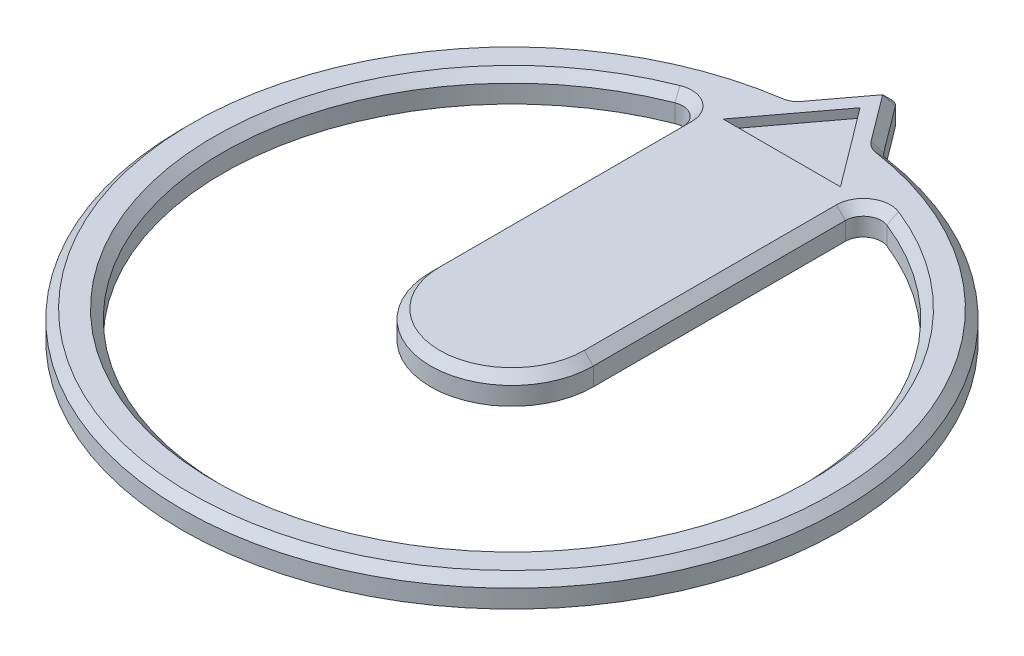
ISO-10303-21;
HEADER;
FILE_DESCRIPTION(('STEP AP214'),'2;1');
FILE_NAME('part.step','',(''),(''),'','','');
FILE_SCHEMA(('AUTOMOTIVE_DESIGN { 1 0 10303 214 1 1 1 1 }'));
ENDSEC;
DATA;
#1=APPLICATION_CONTEXT('core data for automotive mechanical design processes');
#2=APPLICATION_PROTOCOL_DEFINITION('international standard','automotive_design',2000,#1);
#3=PRODUCT_CONTEXT('',#1,'mechanical');
#4=PRODUCT('Part','Part','',(#3));
#5=PRODUCT_RELATED_PRODUCT_CATEGORY('part','',(#4));
#6=PRODUCT_DEFINITION_FORMATION('','',#4);
#7=PRODUCT_DEFINITION_CONTEXT('part definition',#1,'design');
#8=PRODUCT_DEFINITION('design','',#6,#7);
#9=PRODUCT_DEFINITION_SHAPE('','',#8);
#10=(LENGTH_UNIT() NAMED_UNIT(*) SI_UNIT(.MILLI.,.METRE.));
#11=(NAMED_UNIT(*) PLANE_ANGLE_UNIT() SI_UNIT($,.RADIAN.));
#12=(NAMED_UNIT(*) SI_UNIT($,.STERADIAN.) SOLID_ANGLE_UNIT());
#13=UNCERTAINTY_MEASURE_WITH_UNIT(LENGTH_MEASURE(1.E-05),#10,'distance_accuracy_value','');
#14=(GEOMETRIC_REPRESENTATION_CONTEXT(3) GLOBAL_UNCERTAINTY_ASSIGNED_CONTEXT((#13)) GLOBAL_UNIT_ASSIGNED_CONTEXT((#10,
#11,#12)) REPRESENTATION_CONTEXT('',''));
#15=CARTESIAN_POINT('',(0.,0.,0.));
#16=DIRECTION('',(0.,0.,1.));
#17=DIRECTION('',(1.,0.,0.));
#18=AXIS2_PLACEMENT_3D('',#15,#16,#17);
#19=CARTESIAN_POINT('',(0.,0.3,0.));
#20=DIRECTION('',(0.,1.,0.));
#21=DIRECTION('',(0.,0.,1.));
#22=AXIS2_PLACEMENT_3D('',#19,#20,#21);
#23=PLANE('',#22);
#24=DIRECTION('',(-0.6,0.,-0.8));
#25=VECTOR('',#24,1.);
#26=CARTESIAN_POINT('',(0.650000000000001,0.3,-2.98749717322348));
#27=LINE('',#26,#25);
#28=CARTESIAN_POINT('',(0.650000000000001,0.3,-2.98749717322348));
#29=VERTEX_POINT('',#28);
#30=CARTESIAN_POINT('',(0.,0.3,-3.85416383989015));
#31=VERTEX_POINT('',#30);
#32=EDGE_CURVE('E58',#29,#31,#27,.T.);
#33=ORIENTED_EDGE('',*,*,#32,.F.);
#34=DIRECTION('',(1.,0.,0.));
#35=VECTOR('',#34,1.);
#36=CARTESIAN_POINT('',(-0.649999999999999,0.3,-2.98749717322348));
#37=LINE('',#36,#35);
#38=CARTESIAN_POINT('',(-0.649999999999999,0.3,-2.98749717322348));
#39=VERTEX_POINT('',#38);
#40=EDGE_CURVE('E200',#39,#29,#37,.T.);
#41=ORIENTED_EDGE('',*,*,#40,.F.);
#42=DIRECTION('',(-0.599999999999998,0.,0.800000000000001));
#43=VECTOR('',#42,1.);
#44=CARTESIAN_POINT('',(0.,0.3,-3.85416383989015));
#45=LINE('',#44,#43);
#46=EDGE_CURVE('E203',#31,#39,#45,.T.);
#47=ORIENTED_EDGE('',*,*,#46,.F.);
#48=EDGE_LOOP('',(#33,#41,#47));
#49=FACE_BOUND('',#48,.T.);
#50=DIRECTION('',(0.,0.,1.));
#51=VECTOR('',#50,1.);
#52=CARTESIAN_POINT('',(-0.799999999999999,0.3,0.));
#53=LINE('',#52,#51);
#54=CARTESIAN_POINT('',(-0.799999999999999,0.3,-2.79105714739057));
#55=VERTEX_POINT('',#54);
#56=CARTESIAN_POINT('',(-0.799999999999999,0.3,0.));
#57=VERTEX_POINT('',#56);
#58=EDGE_CURVE('E292',#55,#57,#53,.T.);
#59=ORIENTED_EDGE('',*,*,#58,.T.);
#60=CARTESIAN_POINT('',(0.,0.3,0.));
#61=DIRECTION('',(0.,1.,0.));
#62=DIRECTION('',(0.,0.,1.));
#63=AXIS2_PLACEMENT_3D('',#60,#61,#62);
#64=CIRCLE('',#63,0.799999999999999);
#65=CARTESIAN_POINT('',(0.799999999999999,0.3,0.));
#66=VERTEX_POINT('',#65);
#67=EDGE_CURVE('E294',#57,#66,#64,.T.);
#68=ORIENTED_EDGE('',*,*,#67,.T.);
#69=DIRECTION('',(0.,0.,-1.));
#70=VECTOR('',#69,1.);
#71=CARTESIAN_POINT('',(0.799999999999999,0.3,0.));
#72=LINE('',#71,#70);
#73=CARTESIAN_POINT('',(0.799999999999999,0.3,-2.79105714739057));
#74=VERTEX_POINT('',#73);
#75=EDGE_CURVE('E284',#66,#74,#72,.T.);
#76=ORIENTED_EDGE('',*,*,#75,.T.);
#77=CARTESIAN_POINT('',(1.1,0.3,-2.79105714739057));
#78=DIRECTION('',(0.,1.,0.));
#79=DIRECTION('',(0.,0.,1.));
#80=AXIS2_PLACEMENT_3D('',#77,#78,#79);
#81=CIRCLE('',#80,0.300000000000001);
#82=CARTESIAN_POINT('',(1.21,0.3,-3.07016286212963));
#83=VERTEX_POINT('',#82);
#84=EDGE_CURVE('E286',#74,#83,#81,.F.);
#85=ORIENTED_EDGE('',*,*,#84,.T.);
#86=CARTESIAN_POINT('',(0.,0.3,0.));
#87=DIRECTION('',(0.,1.,0.));
#88=DIRECTION('',(0.,0.,1.));
#89=AXIS2_PLACEMENT_3D('',#86,#87,#88);
#90=CIRCLE('',#89,3.3);
#91=CARTESIAN_POINT('',(-1.21,0.3,-3.07016286212963));
#92=VERTEX_POINT('',#91);
#93=EDGE_CURVE('E288',#83,#92,#90,.F.);
#94=ORIENTED_EDGE('',*,*,#93,.T.);
#95=CARTESIAN_POINT('',(-1.1,0.3,-2.79105714739057));
#96=DIRECTION('',(0.,1.,0.));
#97=DIRECTION('',(0.,0.,1.));
#98=AXIS2_PLACEMENT_3D('',#95,#96,#97);
#99=CIRCLE('',#98,0.300000000000001);
#100=EDGE_CURVE('E290',#92,#55,#99,.F.);
#101=ORIENTED_EDGE('',*,*,#100,.T.);
#102=EDGE_LOOP('',(#59,#68,#76,#85,#94,#101));
#103=FACE_BOUND('',#102,.T.);
#104=CARTESIAN_POINT('',(0.,0.3,0.));
#105=DIRECTION('',(0.,1.,0.));
#106=DIRECTION('',(0.,0.,1.));
#107=AXIS2_PLACEMENT_3D('',#104,#105,#106);
#108=CIRCLE('',#107,3.55);
#109=CARTESIAN_POINT('',(-0.516448175063443,0.3,-3.51223309056697));
#110=VERTEX_POINT('',#109);
#111=CARTESIAN_POINT('',(0.516448175063443,0.3,-3.51223309056697));
#112=VERTEX_POINT('',#111);
#113=EDGE_CURVE('E279',#110,#112,#108,.T.);
#114=ORIENTED_EDGE('',*,*,#113,.T.);
#115=CARTESIAN_POINT('',(0.545543846898003,0.3,-3.71010537735948));
#116=DIRECTION('',(0.,1.,0.));
#117=DIRECTION('',(0.,0.,1.));
#118=AXIS2_PLACEMENT_3D('',#115,#116,#117);
#119=CIRCLE('',#118,0.2);
#120=CARTESIAN_POINT('',(0.385543846898003,0.3,-3.59010537735948));
#121=VERTEX_POINT('',#120);
#122=EDGE_CURVE('E281',#112,#121,#119,.F.);
#123=ORIENTED_EDGE('',*,*,#122,.T.);
#124=DIRECTION('',(-0.6,0.,-0.8));
#125=VECTOR('',#124,1.);
#126=CARTESIAN_POINT('',(0.,0.3,-4.10416383989015));
#127=LINE('',#126,#125);
#128=CARTESIAN_POINT('',(0.,0.3,-4.10416383989015));
#129=VERTEX_POINT('',#128);
#130=EDGE_CURVE('E273',#121,#129,#127,.T.);
#131=ORIENTED_EDGE('',*,*,#130,.T.);
#132=DIRECTION('',(-0.6,0.,0.8));
#133=VECTOR('',#132,1.);
#134=CARTESIAN_POINT('',(-0.385543846898002,0.3,-3.59010537735948));
#135=LINE('',#134,#133);
#136=CARTESIAN_POINT('',(-0.385543846898003,0.3,-3.59010537735948));
#137=VERTEX_POINT('',#136);
#138=EDGE_CURVE('E275',#129,#137,#135,.T.);
#139=ORIENTED_EDGE('',*,*,#138,.T.);
#140=CARTESIAN_POINT('',(-0.545543846898003,0.3,-3.71010537735948));
#141=DIRECTION('',(0.,1.,0.));
#142=DIRECTION('',(0.,0.,1.));
#143=AXIS2_PLACEMENT_3D('',#140,#141,#142);
#144=CIRCLE('',#143,0.2);
#145=EDGE_CURVE('E277',#137,#110,#144,.F.);
#146=ORIENTED_EDGE('',*,*,#145,.T.);
#147=EDGE_LOOP('',(#114,#123,#131,#139,#146));
#148=FACE_BOUND('',#147,.T.);
#149=ADVANCED_FACE('F41',(#49,#103,#148),#23,.T.);
#150=CARTESIAN_POINT('',(0.,-4.69987748727645,0.));
#151=DIRECTION('',(0.,1.,0.));
#152=DIRECTION('',(0.,0.,1.));
#153=AXIS2_PLACEMENT_3D('',#150,#151,#152);
#154=CYLINDRICAL_SURFACE('',#153,0.9);
#155=DIRECTION('',(0.,1.,0.));
#156=VECTOR('',#155,1.);
#157=CARTESIAN_POINT('',(0.9,-4.69987748727645,0.));
#158=LINE('',#157,#156);
#159=CARTESIAN_POINT('',(0.9,0.,0.));
#160=VERTEX_POINT('',#159);
#161=CARTESIAN_POINT('',(0.9,0.199999999999998,0.));
#162=VERTEX_POINT('',#161);
#163=EDGE_CURVE('E226',#160,#162,#158,.T.);
#164=ORIENTED_EDGE('',*,*,#163,.T.);
#165=CARTESIAN_POINT('',(0.,0.199999999999998,0.));
#166=DIRECTION('',(0.,1.,0.));
#167=DIRECTION('',(0.,0.,1.));
#168=AXIS2_PLACEMENT_3D('',#165,#166,#167);
#169=CIRCLE('',#168,0.9);
#170=CARTESIAN_POINT('',(-0.9,0.199999999999998,0.));
#171=VERTEX_POINT('',#170);
#172=EDGE_CURVE('E297',#162,#171,#169,.F.);
#173=ORIENTED_EDGE('',*,*,#172,.T.);
#174=DIRECTION('',(0.,1.,0.));
#175=VECTOR('',#174,1.);
#176=CARTESIAN_POINT('',(-0.9,-4.69987748727645,0.));
#177=LINE('',#176,#175);
#178=CARTESIAN_POINT('',(-0.9,0.,0.));
#179=VERTEX_POINT('',#178);
#180=EDGE_CURVE('E231',#179,#171,#177,.T.);
#181=ORIENTED_EDGE('',*,*,#180,.F.);
#182=CARTESIAN_POINT('',(0.,0.,0.));
#183=DIRECTION('',(0.,1.,0.));
#184=DIRECTION('',(0.,0.,1.));
#185=AXIS2_PLACEMENT_3D('',#182,#183,#184);
#186=CIRCLE('',#185,0.9);
#187=EDGE_CURVE('E230',#160,#179,#186,.F.);
#188=ORIENTED_EDGE('',*,*,#187,.F.);
#189=EDGE_LOOP('',(#164,#173,#181,#188));
#190=FACE_BOUND('',#189,.T.);
#191=ADVANCED_FACE('F408',(#190),#154,.T.);
#192=CARTESIAN_POINT('',(-0.9,-4.69987748727645,0.));
#193=DIRECTION('',(-1.,0.,0.));
#194=DIRECTION('',(0.,0.,1.));
#195=AXIS2_PLACEMENT_3D('',#192,#193,#194);
#196=PLANE('',#195);
#197=ORIENTED_EDGE('',*,*,#180,.T.);
#198=DIRECTION('',(0.,0.,-1.));
#199=VECTOR('',#198,1.);
#200=CARTESIAN_POINT('',(-0.9,0.199999999999998,0.));
#201=LINE('',#200,#199);
#202=CARTESIAN_POINT('',(-0.9,0.199999999999998,-2.79105714739057));
#203=VERTEX_POINT('',#202);
#204=EDGE_CURVE('E300',#171,#203,#201,.T.);
#205=ORIENTED_EDGE('',*,*,#204,.T.);
#206=DIRECTION('',(0.,1.,0.));
#207=VECTOR('',#206,1.);
#208=CARTESIAN_POINT('',(-0.9,0.,-2.79105714739057));
#209=LINE('',#208,#207);
#210=CARTESIAN_POINT('',(-0.9,0.,-2.79105714739057));
#211=VERTEX_POINT('',#210);
#212=EDGE_CURVE('E247',#203,#211,#209,.F.);
#213=ORIENTED_EDGE('',*,*,#212,.T.);
#214=DIRECTION('',(0.,0.,-1.));
#215=VECTOR('',#214,1.);
#216=CARTESIAN_POINT('',(-0.9,0.,0.));
#217=LINE('',#216,#215);
#218=EDGE_CURVE('E227',#179,#211,#217,.T.);
#219=ORIENTED_EDGE('',*,*,#218,.F.);
#220=EDGE_LOOP('',(#197,#205,#213,#219));
#221=FACE_BOUND('',#220,.T.);
#222=ADVANCED_FACE('F414',(#221),#196,.T.);
#223=CARTESIAN_POINT('',(0.9,-4.69987748727645,0.));
#224=DIRECTION('',(1.,0.,0.));
#225=DIRECTION('',(0.,0.,-1.));
#226=AXIS2_PLACEMENT_3D('',#223,#224,#225);
#227=PLANE('',#226);
#228=DIRECTION('',(0.,1.,0.));
#229=VECTOR('',#228,1.);
#230=CARTESIAN_POINT('',(0.9,0.3,-2.79105714739057));
#231=LINE('',#230,#229);
#232=CARTESIAN_POINT('',(0.9,0.,-2.79105714739057));
#233=VERTEX_POINT('',#232);
#234=CARTESIAN_POINT('',(0.9,0.199999999999998,-2.79105714739057));
#235=VERTEX_POINT('',#234);
#236=EDGE_CURVE('E244',#233,#235,#231,.T.);
#237=ORIENTED_EDGE('',*,*,#236,.T.);
#238=DIRECTION('',(0.,0.,1.));
#239=VECTOR('',#238,1.);
#240=CARTESIAN_POINT('',(0.9,0.199999999999998,0.));
#241=LINE('',#240,#239);
#242=EDGE_CURVE('E308',#235,#162,#241,.T.);
#243=ORIENTED_EDGE('',*,*,#242,.T.);
#244=ORIENTED_EDGE('',*,*,#163,.F.);
#245=DIRECTION('',(0.,0.,1.));
#246=VECTOR('',#245,1.);
#247=CARTESIAN_POINT('',(0.9,0.,0.));
#248=LINE('',#247,#246);
#249=EDGE_CURVE('E233',#233,#160,#248,.T.);
#250=ORIENTED_EDGE('',*,*,#249,.F.);
#251=EDGE_LOOP('',(#237,#243,#244,#250));
#252=FACE_BOUND('',#251,.T.);
#253=ADVANCED_FACE('F423',(#252),#227,.T.);
#254=CARTESIAN_POINT('',(0.,0.,0.));
#255=DIRECTION('',(0.,1.,0.));
#256=DIRECTION('',(0.,0.,1.));
#257=AXIS2_PLACEMENT_3D('',#254,#255,#256);
#258=PLANE('',#257);
#259=DIRECTION('',(0.6,0.,-0.8));
#260=VECTOR('',#259,1.);
#261=CARTESIAN_POINT('',(-2.04999864314727,0.,-1.53749898236046));
#262=LINE('',#261,#260);
#263=CARTESIAN_POINT('',(-0.465543846898003,0.,-3.65010537735948));
#264=VERTEX_POINT('',#263);
#265=CARTESIAN_POINT('',(-0.0799999999999993,0.,-4.16416383989015));
#266=VERTEX_POINT('',#265);
#267=EDGE_CURVE('E220',#264,#266,#262,.T.);
#268=ORIENTED_EDGE('',*,*,#267,.T.);
#269=CARTESIAN_POINT('',(0.,0.,-4.10416383989015));
#270=DIRECTION('',(0.,1.,0.));
#271=DIRECTION('',(0.,0.,1.));
#272=AXIS2_PLACEMENT_3D('',#269,#270,#271);
#273=CIRCLE('',#272,0.1);
#274=CARTESIAN_POINT('',(0.0799999999999993,0.,-4.16416383989015));
#275=VERTEX_POINT('',#274);
#276=EDGE_CURVE('E267',#266,#275,#273,.F.);
#277=ORIENTED_EDGE('',*,*,#276,.T.);
#278=DIRECTION('',(0.6,0.,0.8));
#279=VECTOR('',#278,1.);
#280=CARTESIAN_POINT('',(2.04999864314727,0.,-1.53749898236046));
#281=LINE('',#280,#279);
#282=CARTESIAN_POINT('',(0.465543846898003,0.,-3.65010537735948));
#283=VERTEX_POINT('',#282);
#284=EDGE_CURVE('E213',#275,#283,#281,.T.);
#285=ORIENTED_EDGE('',*,*,#284,.T.);
#286=CARTESIAN_POINT('',(0.545543846898003,0.,-3.71010537735948));
#287=DIRECTION('',(0.,1.,0.));
#288=DIRECTION('',(0.,0.,1.));
#289=AXIS2_PLACEMENT_3D('',#286,#287,#288);
#290=CIRCLE('',#289,0.1);
#291=CARTESIAN_POINT('',(0.530996010980723,0.,-3.61116923396323));
#292=VERTEX_POINT('',#291);
#293=EDGE_CURVE('E269',#283,#292,#290,.T.);
#294=ORIENTED_EDGE('',*,*,#293,.T.);
#295=CARTESIAN_POINT('',(0.,0.,0.));
#296=DIRECTION('',(0.,1.,0.));
#297=DIRECTION('',(0.,0.,1.));
#298=AXIS2_PLACEMENT_3D('',#295,#296,#297);
#299=CIRCLE('',#298,3.65);
#300=CARTESIAN_POINT('',(-0.530996010980723,0.,-3.61116923396323));
#301=VERTEX_POINT('',#300);
#302=EDGE_CURVE('E216',#292,#301,#299,.F.);
#303=ORIENTED_EDGE('',*,*,#302,.T.);
#304=CARTESIAN_POINT('',(-0.545543846898003,0.,-3.71010537735948));
#305=DIRECTION('',(0.,1.,0.));
#306=DIRECTION('',(0.,0.,1.));
#307=AXIS2_PLACEMENT_3D('',#304,#305,#306);
#308=CIRCLE('',#307,0.1);
#309=EDGE_CURVE('E271',#301,#264,#308,.T.);
#310=ORIENTED_EDGE('',*,*,#309,.T.);
#311=EDGE_LOOP('',(#268,#277,#285,#294,#303,#310));
#312=FACE_BOUND('',#311,.T.);
#313=ORIENTED_EDGE('',*,*,#218,.T.);
#314=CARTESIAN_POINT('',(-1.1,0.,-2.79105714739057));
#315=DIRECTION('',(0.,1.,0.));
#316=DIRECTION('',(0.,0.,1.));
#317=AXIS2_PLACEMENT_3D('',#314,#315,#316);
#318=CIRCLE('',#317,0.2);
#319=CARTESIAN_POINT('',(-1.17333333333333,0.,-2.97712762388328));
#320=VERTEX_POINT('',#319);
#321=EDGE_CURVE('E251',#211,#320,#318,.T.);
#322=ORIENTED_EDGE('',*,*,#321,.T.);
#323=CARTESIAN_POINT('',(0.,0.,0.));
#324=DIRECTION('',(0.,1.,0.));
#325=DIRECTION('',(0.,0.,1.));
#326=AXIS2_PLACEMENT_3D('',#323,#324,#325);
#327=CIRCLE('',#326,3.2);
#328=CARTESIAN_POINT('',(1.17333333333333,0.,-2.97712762388328));
#329=VERTEX_POINT('',#328);
#330=EDGE_CURVE('E223',#320,#329,#327,.T.);
#331=ORIENTED_EDGE('',*,*,#330,.T.);
#332=CARTESIAN_POINT('',(1.1,0.,-2.79105714739057));
#333=DIRECTION('',(0.,1.,0.));
#334=DIRECTION('',(0.,0.,1.));
#335=AXIS2_PLACEMENT_3D('',#332,#333,#334);
#336=CIRCLE('',#335,0.2);
#337=EDGE_CURVE('E249',#329,#233,#336,.T.);
#338=ORIENTED_EDGE('',*,*,#337,.T.);
#339=ORIENTED_EDGE('',*,*,#249,.T.);
#340=ORIENTED_EDGE('',*,*,#187,.T.);
#341=EDGE_LOOP('',(#313,#322,#331,#338,#339,#340));
#342=FACE_BOUND('',#341,.T.);
#343=ADVANCED_FACE('F366',(#312,#342),#258,.F.);
#344=CARTESIAN_POINT('',(0.,0.3,0.));
#345=DIRECTION('',(0.,-1.,0.));
#346=DIRECTION('',(0.,0.,-1.));
#347=AXIS2_PLACEMENT_3D('',#344,#345,#346);
#348=CYLINDRICAL_SURFACE('',#347,3.2);
#349=DIRECTION('',(0.,-1.,0.));
#350=VECTOR('',#349,1.);
#351=CARTESIAN_POINT('',(-1.17333333333333,0.3,-2.97712762388328));
#352=LINE('',#351,#350);
#353=CARTESIAN_POINT('',(-1.17333333333333,0.199999999999998,-2.97712762388328));
#354=VERTEX_POINT('',#353);
#355=EDGE_CURVE('E239',#320,#354,#352,.F.);
#356=ORIENTED_EDGE('',*,*,#355,.T.);
#357=CARTESIAN_POINT('',(0.,0.199999999999998,0.));
#358=DIRECTION('',(0.,1.,0.));
#359=DIRECTION('',(0.,0.,1.));
#360=AXIS2_PLACEMENT_3D('',#357,#358,#359);
#361=CIRCLE('',#360,3.2);
#362=CARTESIAN_POINT('',(1.17333333333333,0.199999999999998,-2.97712762388328));
#363=VERTEX_POINT('',#362);
#364=EDGE_CURVE('E304',#354,#363,#361,.T.);
#365=ORIENTED_EDGE('',*,*,#364,.T.);
#366=DIRECTION('',(0.,-1.,0.));
#367=VECTOR('',#366,1.);
#368=CARTESIAN_POINT('',(1.17333333333333,0.3,-2.97712762388328));
#369=LINE('',#368,#367);
#370=EDGE_CURVE('E242',#363,#329,#369,.T.);
#371=ORIENTED_EDGE('',*,*,#370,.T.);
#372=ORIENTED_EDGE('',*,*,#330,.F.);
#373=EDGE_LOOP('',(#356,#365,#371,#372));
#374=FACE_BOUND('',#373,.T.);
#375=ADVANCED_FACE('F422',(#374),#348,.F.);
#376=CARTESIAN_POINT('',(2.04999864314727,0.,-1.53749898236046));
#377=DIRECTION('',(-0.8,0.,0.6));
#378=DIRECTION('',(0.6,0.,0.8));
#379=AXIS2_PLACEMENT_3D('',#376,#377,#378);
#380=PLANE('',#379);
#381=DIRECTION('',(0.,1.,0.));
#382=VECTOR('',#381,1.);
#383=CARTESIAN_POINT('',(0.0799999999999998,0.,-4.16416383989015));
#384=LINE('',#383,#382);
#385=CARTESIAN_POINT('',(0.0799999999999998,0.2,-4.16416383989015));
#386=VERTEX_POINT('',#385);
#387=EDGE_CURVE('E258',#275,#386,#384,.T.);
#388=ORIENTED_EDGE('',*,*,#387,.T.);
#389=DIRECTION('',(0.6,0.,0.8));
#390=VECTOR('',#389,1.);
#391=CARTESIAN_POINT('',(0.465543846898003,0.2,-3.65010537735948));
#392=LINE('',#391,#390);
#393=CARTESIAN_POINT('',(0.465543846898003,0.2,-3.65010537735948));
#394=VERTEX_POINT('',#393);
#395=EDGE_CURVE('E12',#386,#394,#392,.T.);
#396=ORIENTED_EDGE('',*,*,#395,.T.);
#397=DIRECTION('',(0.,-1.,0.));
#398=VECTOR('',#397,1.);
#399=CARTESIAN_POINT('',(0.465543846898003,0.,-3.65010537735948));
#400=LINE('',#399,#398);
#401=EDGE_CURVE('E260',#394,#283,#400,.T.);
#402=ORIENTED_EDGE('',*,*,#401,.T.);
#403=ORIENTED_EDGE('',*,*,#284,.F.);
#404=EDGE_LOOP('',(#388,#396,#402,#403));
#405=FACE_BOUND('',#404,.T.);
#406=ADVANCED_FACE('F370',(#405),#380,.F.);
#407=CARTESIAN_POINT('',(-2.04999864314727,0.,-1.53749898236046));
#408=DIRECTION('',(0.8,0.,0.6));
#409=DIRECTION('',(0.6,0.,-0.8));
#410=AXIS2_PLACEMENT_3D('',#407,#408,#409);
#411=PLANE('',#410);
#412=DIRECTION('',(0.,-1.,0.));
#413=VECTOR('',#412,1.);
#414=CARTESIAN_POINT('',(-0.465543846898003,0.3,-3.65010537735948));
#415=LINE('',#414,#413);
#416=CARTESIAN_POINT('',(-0.465543846898003,0.2,-3.65010537735948));
#417=VERTEX_POINT('',#416);
#418=EDGE_CURVE('E264',#264,#417,#415,.F.);
#419=ORIENTED_EDGE('',*,*,#418,.T.);
#420=DIRECTION('',(0.6,0.,-0.8));
#421=VECTOR('',#420,1.);
#422=CARTESIAN_POINT('',(-0.0799999999999996,0.2,-4.16416383989015));
#423=LINE('',#422,#421);
#424=CARTESIAN_POINT('',(-0.0799999999999998,0.200000000000001,-4.16416383989015));
#425=VERTEX_POINT('',#424);
#426=EDGE_CURVE('E317',#417,#425,#423,.T.);
#427=ORIENTED_EDGE('',*,*,#426,.T.);
#428=DIRECTION('',(0.,1.,0.));
#429=VECTOR('',#428,1.);
#430=CARTESIAN_POINT('',(-0.0799999999999998,0.,-4.16416383989015));
#431=LINE('',#430,#429);
#432=EDGE_CURVE('E262',#425,#266,#431,.F.);
#433=ORIENTED_EDGE('',*,*,#432,.T.);
#434=ORIENTED_EDGE('',*,*,#267,.F.);
#435=EDGE_LOOP('',(#419,#427,#433,#434));
#436=FACE_BOUND('',#435,.T.);
#437=ADVANCED_FACE('F359',(#436),#411,.F.);
#438=CARTESIAN_POINT('',(0.,0.,0.));
#439=DIRECTION('',(0.,1.,0.));
#440=DIRECTION('',(0.,0.,1.));
#441=AXIS2_PLACEMENT_3D('',#438,#439,#440);
#442=CYLINDRICAL_SURFACE('',#441,3.65);
#443=DIRECTION('',(0.,1.,0.));
#444=VECTOR('',#443,1.);
#445=CARTESIAN_POINT('',(0.530996010980723,0.,-3.61116923396323));
#446=LINE('',#445,#444);
#447=CARTESIAN_POINT('',(0.530996010980723,0.200000000000001,-3.61116923396323));
#448=VERTEX_POINT('',#447);
#449=EDGE_CURVE('E255',#292,#448,#446,.T.);
#450=ORIENTED_EDGE('',*,*,#449,.T.);
#451=CARTESIAN_POINT('',(0.,0.200000000000001,0.));
#452=DIRECTION('',(0.,1.,0.));
#453=DIRECTION('',(0.,0.,1.));
#454=AXIS2_PLACEMENT_3D('',#451,#452,#453);
#455=CIRCLE('',#454,3.65);
#456=CARTESIAN_POINT('',(-0.530996010980723,0.200000000000001,-3.61116923396323));
#457=VERTEX_POINT('',#456);
#458=EDGE_CURVE('E313',#448,#457,#455,.F.);
#459=ORIENTED_EDGE('',*,*,#458,.T.);
#460=DIRECTION('',(0.,1.,0.));
#461=VECTOR('',#460,1.);
#462=CARTESIAN_POINT('',(-0.530996010980723,0.,-3.61116923396323));
#463=LINE('',#462,#461);
#464=EDGE_CURVE('E253',#457,#301,#463,.F.);
#465=ORIENTED_EDGE('',*,*,#464,.T.);
#466=ORIENTED_EDGE('',*,*,#302,.F.);
#467=EDGE_LOOP('',(#450,#459,#465,#466));
#468=FACE_BOUND('',#467,.T.);
#469=ADVANCED_FACE('F392',(#468),#442,.T.);
#470=CARTESIAN_POINT('',(1.1,0.3,-2.79105714739057));
#471=DIRECTION('',(0.,-1.,0.));
#472=DIRECTION('',(0.,0.,-1.));
#473=AXIS2_PLACEMENT_3D('',#470,#471,#472);
#474=CYLINDRICAL_SURFACE('',#473,0.2);
#475=ORIENTED_EDGE('',*,*,#370,.F.);
#476=CARTESIAN_POINT('',(1.1,0.199999999999998,-2.79105714739057));
#477=DIRECTION('',(0.,1.,0.));
#478=DIRECTION('',(0.,0.,1.));
#479=AXIS2_PLACEMENT_3D('',#476,#477,#478);
#480=CIRCLE('',#479,0.2);
#481=EDGE_CURVE('E306',#363,#235,#480,.T.);
#482=ORIENTED_EDGE('',*,*,#481,.T.);
#483=ORIENTED_EDGE('',*,*,#236,.F.);
#484=ORIENTED_EDGE('',*,*,#337,.F.);
#485=EDGE_LOOP('',(#475,#482,#483,#484));
#486=FACE_BOUND('',#485,.T.);
#487=ADVANCED_FACE('F424',(#486),#474,.F.);
#488=CARTESIAN_POINT('',(-1.1,0.3,-2.79105714739057));
#489=DIRECTION('',(0.,-1.,0.));
#490=DIRECTION('',(0.,0.,-1.));
#491=AXIS2_PLACEMENT_3D('',#488,#489,#490);
#492=CYLINDRICAL_SURFACE('',#491,0.2);
#493=ORIENTED_EDGE('',*,*,#212,.F.);
#494=CARTESIAN_POINT('',(-1.1,0.199999999999998,-2.79105714739057));
#495=DIRECTION('',(0.,1.,0.));
#496=DIRECTION('',(0.,0.,1.));
#497=AXIS2_PLACEMENT_3D('',#494,#495,#496);
#498=CIRCLE('',#497,0.2);
#499=EDGE_CURVE('E302',#203,#354,#498,.T.);
#500=ORIENTED_EDGE('',*,*,#499,.T.);
#501=ORIENTED_EDGE('',*,*,#355,.F.);
#502=ORIENTED_EDGE('',*,*,#321,.F.);
#503=EDGE_LOOP('',(#493,#500,#501,#502));
#504=FACE_BOUND('',#503,.T.);
#505=ADVANCED_FACE('F405',(#504),#492,.F.);
#506=CARTESIAN_POINT('',(0.545543846898003,0.,-3.71010537735948));
#507=DIRECTION('',(0.,1.,0.));
#508=DIRECTION('',(0.,0.,1.));
#509=AXIS2_PLACEMENT_3D('',#506,#507,#508);
#510=CYLINDRICAL_SURFACE('',#509,0.1);
#511=ORIENTED_EDGE('',*,*,#401,.F.);
#512=CARTESIAN_POINT('',(0.545543846898003,0.200000000000001,-3.71010537735948));
#513=DIRECTION('',(0.,1.,0.));
#514=DIRECTION('',(0.,0.,1.));
#515=AXIS2_PLACEMENT_3D('',#512,#513,#514);
#516=CIRCLE('',#515,0.1);
#517=EDGE_CURVE('E310',#394,#448,#516,.T.);
#518=ORIENTED_EDGE('',*,*,#517,.T.);
#519=ORIENTED_EDGE('',*,*,#449,.F.);
#520=ORIENTED_EDGE('',*,*,#293,.F.);
#521=EDGE_LOOP('',(#511,#518,#519,#520));
#522=FACE_BOUND('',#521,.T.);
#523=ADVANCED_FACE('F375',(#522),#510,.F.);
#524=CARTESIAN_POINT('',(-0.545543846898003,0.,-3.71010537735948));
#525=DIRECTION('',(0.,1.,0.));
#526=DIRECTION('',(0.,0.,1.));
#527=AXIS2_PLACEMENT_3D('',#524,#525,#526);
#528=CYLINDRICAL_SURFACE('',#527,0.1);
#529=ORIENTED_EDGE('',*,*,#464,.F.);
#530=CARTESIAN_POINT('',(-0.545543846898003,0.200000000000001,-3.71010537735948));
#531=DIRECTION('',(0.,1.,0.));
#532=DIRECTION('',(0.,0.,1.));
#533=AXIS2_PLACEMENT_3D('',#530,#531,#532);
#534=CIRCLE('',#533,0.1);
#535=EDGE_CURVE('E315',#457,#417,#534,.T.);
#536=ORIENTED_EDGE('',*,*,#535,.T.);
#537=ORIENTED_EDGE('',*,*,#418,.F.);
#538=ORIENTED_EDGE('',*,*,#309,.F.);
#539=EDGE_LOOP('',(#529,#536,#537,#538));
#540=FACE_BOUND('',#539,.T.);
#541=ADVANCED_FACE('F396',(#540),#528,.F.);
#542=CARTESIAN_POINT('',(0.,0.,-4.10416383989015));
#543=DIRECTION('',(0.,1.,0.));
#544=DIRECTION('',(0.,0.,1.));
#545=AXIS2_PLACEMENT_3D('',#542,#543,#544);
#546=CYLINDRICAL_SURFACE('',#545,0.1);
#547=ORIENTED_EDGE('',*,*,#432,.F.);
#548=CARTESIAN_POINT('',(0.,0.200000000000001,-4.10416383989015));
#549=DIRECTION('',(0.,1.,0.));
#550=DIRECTION('',(0.,0.,1.));
#551=AXIS2_PLACEMENT_3D('',#548,#549,#550);
#552=CIRCLE('',#551,0.1);
#553=EDGE_CURVE('E50',#425,#386,#552,.F.);
#554=ORIENTED_EDGE('',*,*,#553,.T.);
#555=ORIENTED_EDGE('',*,*,#387,.F.);
#556=ORIENTED_EDGE('',*,*,#276,.F.);
#557=EDGE_LOOP('',(#547,#554,#555,#556));
#558=FACE_BOUND('',#557,.T.);
#559=ADVANCED_FACE('F363',(#558),#546,.T.);
#560=CARTESIAN_POINT('',(0.,0.199999999999998,0.));
#561=DIRECTION('',(0.,1.,0.));
#562=DIRECTION('',(0.,0.,1.));
#563=AXIS2_PLACEMENT_3D('',#560,#561,#562);
#564=CONICAL_SURFACE('',#563,3.2,0.785398163397444);
#565=DIRECTION('',(0.259272486435066,0.70710678118655,-0.657858478533016));
#566=VECTOR('',#565,1.);
#567=CARTESIAN_POINT('',(1.17333333333333,0.199999999999998,-2.97712762388328));
#568=LINE('',#567,#566);
#569=EDGE_CURVE('E330',#363,#83,#568,.T.);
#570=ORIENTED_EDGE('',*,*,#569,.F.);
#571=ORIENTED_EDGE('',*,*,#364,.F.);
#572=DIRECTION('',(0.259272486435066,-0.707106781186551,0.657858478533014));
#573=VECTOR('',#572,1.);
#574=CARTESIAN_POINT('',(-1.21,0.3,-3.07016286212963));
#575=LINE('',#574,#573);
#576=EDGE_CURVE('E217',#92,#354,#575,.T.);
#577=ORIENTED_EDGE('',*,*,#576,.F.);
#578=ORIENTED_EDGE('',*,*,#93,.F.);
#579=EDGE_LOOP('',(#570,#571,#577,#578));
#580=FACE_BOUND('',#579,.T.);
#581=ADVANCED_FACE('F403',(#580),#564,.F.);
#582=CARTESIAN_POINT('',(-1.1,0.3,-2.79105714739057));
#583=DIRECTION('',(0.,1.,0.));
#584=DIRECTION('',(0.,0.,1.));
#585=AXIS2_PLACEMENT_3D('',#582,#583,#584);
#586=CONICAL_SURFACE('',#585,0.300000000000001,0.785398163397444);
#587=ORIENTED_EDGE('',*,*,#576,.T.);
#588=ORIENTED_EDGE('',*,*,#499,.F.);
#589=DIRECTION('',(-0.707106781186544,-0.707106781186551,0.));
#590=VECTOR('',#589,1.);
#591=CARTESIAN_POINT('',(-0.799999999999999,0.3,-2.79105714739057));
#592=LINE('',#591,#590);
#593=EDGE_CURVE('E327',#55,#203,#592,.T.);
#594=ORIENTED_EDGE('',*,*,#593,.F.);
#595=ORIENTED_EDGE('',*,*,#100,.F.);
#596=EDGE_LOOP('',(#587,#588,#594,#595));
#597=FACE_BOUND('',#596,.T.);
#598=ADVANCED_FACE('F440',(#597),#586,.F.);
#599=CARTESIAN_POINT('',(1.1,0.3,-2.79105714739057));
#600=DIRECTION('',(0.,1.,0.));
#601=DIRECTION('',(0.,0.,1.));
#602=AXIS2_PLACEMENT_3D('',#599,#600,#601);
#603=CONICAL_SURFACE('',#602,0.300000000000001,0.785398163397444);
#604=ORIENTED_EDGE('',*,*,#569,.T.);
#605=ORIENTED_EDGE('',*,*,#84,.F.);
#606=DIRECTION('',(-0.707106781186544,0.707106781186551,0.));
#607=VECTOR('',#606,1.);
#608=CARTESIAN_POINT('',(0.9,0.199999999999998,-2.79105714739057));
#609=LINE('',#608,#607);
#610=EDGE_CURVE('E324',#235,#74,#609,.T.);
#611=ORIENTED_EDGE('',*,*,#610,.F.);
#612=ORIENTED_EDGE('',*,*,#481,.F.);
#613=EDGE_LOOP('',(#604,#605,#611,#612));
#614=FACE_BOUND('',#613,.T.);
#615=ADVANCED_FACE('F474',(#614),#603,.F.);
#616=CARTESIAN_POINT('',(-0.799999999999999,0.3,0.));
#617=DIRECTION('',(0.707106781186551,-0.707106781186544,0.));
#618=DIRECTION('',(0.,0.,1.));
#619=AXIS2_PLACEMENT_3D('',#616,#617,#618);
#620=PLANE('',#619);
#621=ORIENTED_EDGE('',*,*,#593,.T.);
#622=ORIENTED_EDGE('',*,*,#204,.F.);
#623=DIRECTION('',(-0.707106781186544,-0.707106781186551,0.));
#624=VECTOR('',#623,1.);
#625=CARTESIAN_POINT('',(-0.799999999999999,0.3,0.));
#626=LINE('',#625,#624);
#627=EDGE_CURVE('E322',#57,#171,#626,.T.);
#628=ORIENTED_EDGE('',*,*,#627,.F.);
#629=ORIENTED_EDGE('',*,*,#58,.F.);
#630=EDGE_LOOP('',(#621,#622,#628,#629));
#631=FACE_BOUND('',#630,.T.);
#632=ADVANCED_FACE('F446',(#631),#620,.F.);
#633=CARTESIAN_POINT('',(0.799999999999999,0.3,0.));
#634=DIRECTION('',(-0.707106781186551,-0.707106781186544,0.));
#635=DIRECTION('',(0.,0.,-1.));
#636=AXIS2_PLACEMENT_3D('',#633,#634,#635);
#637=PLANE('',#636);
#638=ORIENTED_EDGE('',*,*,#610,.T.);
#639=ORIENTED_EDGE('',*,*,#75,.F.);
#640=DIRECTION('',(-0.707106781186544,0.707106781186551,0.));
#641=VECTOR('',#640,1.);
#642=CARTESIAN_POINT('',(0.9,0.199999999999998,0.));
#643=LINE('',#642,#641);
#644=EDGE_CURVE('E320',#162,#66,#643,.T.);
#645=ORIENTED_EDGE('',*,*,#644,.F.);
#646=ORIENTED_EDGE('',*,*,#242,.F.);
#647=EDGE_LOOP('',(#638,#639,#645,#646));
#648=FACE_BOUND('',#647,.T.);
#649=ADVANCED_FACE('F471',(#648),#637,.F.);
#650=CARTESIAN_POINT('',(0.,0.3,0.));
#651=DIRECTION('',(0.,-1.,0.));
#652=DIRECTION('',(0.,0.,-1.));
#653=AXIS2_PLACEMENT_3D('',#650,#651,#652);
#654=CONICAL_SURFACE('',#653,0.799999999999999,0.785398163397444);
#655=ORIENTED_EDGE('',*,*,#627,.T.);
#656=ORIENTED_EDGE('',*,*,#172,.F.);
#657=ORIENTED_EDGE('',*,*,#644,.T.);
#658=ORIENTED_EDGE('',*,*,#67,.F.);
#659=EDGE_LOOP('',(#655,#656,#657,#658));
#660=FACE_BOUND('',#659,.T.);
#661=ADVANCED_FACE('F467',(#660),#654,.T.);
#662=CARTESIAN_POINT('',(-2.04999864314727,0.200000000000001,-1.53749898236046));
#663=DIRECTION('',(-0.565685424949235,0.707106781186551,-0.424264068711927));
#664=DIRECTION('',(-0.6,0.,0.8));
#665=AXIS2_PLACEMENT_3D('',#662,#663,#664);
#666=PLANE('',#665);
#667=DIRECTION('',(0.565685424949241,0.707106781186545,0.424264068711929));
#668=VECTOR('',#667,1.);
#669=CARTESIAN_POINT('',(-0.0799999999999996,0.2,-4.16416383989015));
#670=LINE('',#669,#668);
#671=EDGE_CURVE('E343',#425,#129,#670,.T.);
#672=ORIENTED_EDGE('',*,*,#671,.F.);
#673=ORIENTED_EDGE('',*,*,#426,.F.);
#674=DIRECTION('',(-0.56568542494924,-0.707106781186544,-0.424264068711931));
#675=VECTOR('',#674,1.);
#676=CARTESIAN_POINT('',(-0.385543846898003,0.3,-3.59010537735948));
#677=LINE('',#676,#675);
#678=EDGE_CURVE('E45',#137,#417,#677,.T.);
#679=ORIENTED_EDGE('',*,*,#678,.F.);
#680=ORIENTED_EDGE('',*,*,#138,.F.);
#681=EDGE_LOOP('',(#672,#673,#679,#680));
#682=FACE_BOUND('',#681,.T.);
#683=ADVANCED_FACE('F43',(#682),#666,.T.);
#684=CARTESIAN_POINT('',(-0.545543846898003,0.3,-3.71010537735948));
#685=DIRECTION('',(0.,1.,0.));
#686=DIRECTION('',(0.,0.,1.));
#687=AXIS2_PLACEMENT_3D('',#684,#685,#686);
#688=CONICAL_SURFACE('',#687,0.2,0.785398163397453);
#689=ORIENTED_EDGE('',*,*,#678,.T.);
#690=ORIENTED_EDGE('',*,*,#535,.F.);
#691=DIRECTION('',(-0.10286873428698,-0.707106781186544,-0.699584178999354));
#692=VECTOR('',#691,1.);
#693=CARTESIAN_POINT('',(-0.516448175063443,0.3,-3.51223309056697));
#694=LINE('',#693,#692);
#695=EDGE_CURVE('E341',#110,#457,#694,.T.);
#696=ORIENTED_EDGE('',*,*,#695,.F.);
#697=ORIENTED_EDGE('',*,*,#145,.F.);
#698=EDGE_LOOP('',(#689,#690,#696,#697));
#699=FACE_BOUND('',#698,.T.);
#700=ADVANCED_FACE('F353',(#699),#688,.F.);
#701=CARTESIAN_POINT('',(0.,0.200000000000001,-4.10416383989015));
#702=DIRECTION('',(0.,-1.,0.));
#703=DIRECTION('',(0.,0.,-1.));
#704=AXIS2_PLACEMENT_3D('',#701,#702,#703);
#705=CONICAL_SURFACE('',#704,0.1,0.785398163397453);
#706=ORIENTED_EDGE('',*,*,#553,.F.);
#707=ORIENTED_EDGE('',*,*,#671,.T.);
#708=DIRECTION('',(-0.56568542494924,0.707106781186545,0.424264068711931));
#709=VECTOR('',#708,1.);
#710=CARTESIAN_POINT('',(0.0799999999999998,0.200000000000001,-4.16416383989015));
#711=LINE('',#710,#709);
#712=EDGE_CURVE('E338',#386,#129,#711,.T.);
#713=ORIENTED_EDGE('',*,*,#712,.F.);
#714=EDGE_LOOP('',(#706,#707,#713));
#715=FACE_BOUND('',#714,.T.);
#716=ADVANCED_FACE('F493',(#715),#705,.T.);
#717=CARTESIAN_POINT('',(0.,0.200000000000001,0.));
#718=DIRECTION('',(0.,-1.,0.));
#719=DIRECTION('',(0.,0.,-1.));
#720=AXIS2_PLACEMENT_3D('',#717,#718,#719);
#721=CONICAL_SURFACE('',#720,3.65,0.785398163397453);
#722=ORIENTED_EDGE('',*,*,#695,.T.);
#723=ORIENTED_EDGE('',*,*,#458,.F.);
#724=DIRECTION('',(0.102868734286979,-0.707106781186545,-0.699584178999352));
#725=VECTOR('',#724,1.);
#726=CARTESIAN_POINT('',(0.516448175063443,0.3,-3.51223309056697));
#727=LINE('',#726,#725);
#728=EDGE_CURVE('E336',#112,#448,#727,.T.);
#729=ORIENTED_EDGE('',*,*,#728,.F.);
#730=ORIENTED_EDGE('',*,*,#113,.F.);
#731=EDGE_LOOP('',(#722,#723,#729,#730));
#732=FACE_BOUND('',#731,.T.);
#733=ADVANCED_FACE('F389',(#732),#721,.T.);
#734=CARTESIAN_POINT('',(2.04999864314727,0.200000000000001,-1.53749898236046));
#735=DIRECTION('',(0.565685424949235,0.707106781186551,-0.424264068711927));
#736=DIRECTION('',(-0.6,0.,-0.8));
#737=AXIS2_PLACEMENT_3D('',#734,#735,#736);
#738=PLANE('',#737);
#739=ORIENTED_EDGE('',*,*,#712,.T.);
#740=ORIENTED_EDGE('',*,*,#130,.F.);
#741=DIRECTION('',(-0.56568542494924,0.707106781186546,0.424264068711929));
#742=VECTOR('',#741,1.);
#743=CARTESIAN_POINT('',(0.465543846898003,0.2,-3.65010537735948));
#744=LINE('',#743,#742);
#745=EDGE_CURVE('E211',#394,#121,#744,.T.);
#746=ORIENTED_EDGE('',*,*,#745,.F.);
#747=ORIENTED_EDGE('',*,*,#395,.F.);
#748=EDGE_LOOP('',(#739,#740,#746,#747));
#749=FACE_BOUND('',#748,.T.);
#750=ADVANCED_FACE('F385',(#749),#738,.T.);
#751=CARTESIAN_POINT('',(0.545543846898003,0.3,-3.71010537735948));
#752=DIRECTION('',(0.,1.,0.));
#753=DIRECTION('',(0.,0.,1.));
#754=AXIS2_PLACEMENT_3D('',#751,#752,#753);
#755=CONICAL_SURFACE('',#754,0.2,0.785398163397453);
#756=ORIENTED_EDGE('',*,*,#728,.T.);
#757=ORIENTED_EDGE('',*,*,#517,.F.);
#758=ORIENTED_EDGE('',*,*,#745,.T.);
#759=ORIENTED_EDGE('',*,*,#122,.F.);
#760=EDGE_LOOP('',(#756,#757,#758,#759));
#761=FACE_BOUND('',#760,.T.);
#762=ADVANCED_FACE('F379',(#761),#755,.F.);
#763=CARTESIAN_POINT('',(0.650000000000001,0.2,-2.98749717322348));
#764=DIRECTION('',(0.8,0.,-0.6));
#765=DIRECTION('',(-0.6,0.,-0.8));
#766=AXIS2_PLACEMENT_3D('',#763,#764,#765);
#767=PLANE('',#766);
#768=ORIENTED_EDGE('',*,*,#32,.T.);
#769=DIRECTION('',(0.,1.,0.));
#770=VECTOR('',#769,1.);
#771=CARTESIAN_POINT('',(0.,0.2,-3.85416383989015));
#772=LINE('',#771,#770);
#773=CARTESIAN_POINT('',(0.,0.2,-3.85416383989015));
#774=VERTEX_POINT('',#773);
#775=EDGE_CURVE('E181',#774,#31,#772,.T.);
#776=ORIENTED_EDGE('',*,*,#775,.F.);
#777=DIRECTION('',(-0.6,0.,-0.8));
#778=VECTOR('',#777,1.);
#779=CARTESIAN_POINT('',(0.650000000000001,0.2,-2.98749717322348));
#780=LINE('',#779,#778);
#781=CARTESIAN_POINT('',(0.650000000000001,0.2,-2.98749717322348));
#782=VERTEX_POINT('',#781);
#783=EDGE_CURVE('E185',#782,#774,#780,.T.);
#784=ORIENTED_EDGE('',*,*,#783,.F.);
#785=DIRECTION('',(0.,1.,0.));
#786=VECTOR('',#785,1.);
#787=CARTESIAN_POINT('',(0.650000000000001,0.2,-2.98749717322348));
#788=LINE('',#787,#786);
#789=EDGE_CURVE('E209',#782,#29,#788,.T.);
#790=ORIENTED_EDGE('',*,*,#789,.T.);
#791=EDGE_LOOP('',(#768,#776,#784,#790));
#792=FACE_BOUND('',#791,.T.);
#793=ADVANCED_FACE('F183',(#792),#767,.F.);
#794=CARTESIAN_POINT('',(-0.649999999999999,0.2,-2.98749717322348));
#795=DIRECTION('',(0.,0.,1.));
#796=DIRECTION('',(1.,0.,0.));
#797=AXIS2_PLACEMENT_3D('',#794,#795,#796);
#798=PLANE('',#797);
#799=ORIENTED_EDGE('',*,*,#40,.T.);
#800=ORIENTED_EDGE('',*,*,#789,.F.);
#801=DIRECTION('',(1.,0.,0.));
#802=VECTOR('',#801,1.);
#803=CARTESIAN_POINT('',(-0.649999999999999,0.2,-2.98749717322348));
#804=LINE('',#803,#802);
#805=CARTESIAN_POINT('',(-0.649999999999999,0.2,-2.98749717322348));
#806=VERTEX_POINT('',#805);
#807=EDGE_CURVE('E191',#806,#782,#804,.T.);
#808=ORIENTED_EDGE('',*,*,#807,.F.);
#809=DIRECTION('',(0.,1.,0.));
#810=VECTOR('',#809,1.);
#811=CARTESIAN_POINT('',(-0.649999999999999,0.2,-2.98749717322348));
#812=LINE('',#811,#810);
#813=EDGE_CURVE('E190',#806,#39,#812,.T.);
#814=ORIENTED_EDGE('',*,*,#813,.T.);
#815=EDGE_LOOP('',(#799,#800,#808,#814));
#816=FACE_BOUND('',#815,.T.);
#817=ADVANCED_FACE('F643',(#816),#798,.F.);
#818=CARTESIAN_POINT('',(0.,0.2,-3.85416383989015));
#819=DIRECTION('',(-0.800000000000001,0.,-0.599999999999998));
#820=DIRECTION('',(-0.599999999999998,0.,0.800000000000001));
#821=AXIS2_PLACEMENT_3D('',#818,#819,#820);
#822=PLANE('',#821);
#823=ORIENTED_EDGE('',*,*,#46,.T.);
#824=ORIENTED_EDGE('',*,*,#813,.F.);
#825=DIRECTION('',(-0.599999999999998,0.,0.800000000000001));
#826=VECTOR('',#825,1.);
#827=CARTESIAN_POINT('',(0.,0.2,-3.85416383989015));
#828=LINE('',#827,#826);
#829=EDGE_CURVE('E194',#774,#806,#828,.T.);
#830=ORIENTED_EDGE('',*,*,#829,.F.);
#831=ORIENTED_EDGE('',*,*,#775,.T.);
#832=EDGE_LOOP('',(#823,#824,#830,#831));
#833=FACE_BOUND('',#832,.T.);
#834=ADVANCED_FACE('F195',(#833),#822,.F.);
#835=CARTESIAN_POINT('',(0.,0.2,0.));
#836=DIRECTION('',(0.,1.,0.));
#837=DIRECTION('',(0.,0.,1.));
#838=AXIS2_PLACEMENT_3D('',#835,#836,#837);
#839=PLANE('',#838);
#840=ORIENTED_EDGE('',*,*,#783,.T.);
#841=ORIENTED_EDGE('',*,*,#829,.T.);
#842=ORIENTED_EDGE('',*,*,#807,.T.);
#843=EDGE_LOOP('',(#840,#841,#842));
#844=FACE_BOUND('',#843,.T.);
#845=ADVANCED_FACE('F199',(#844),#839,.T.);
#846=CLOSED_SHELL('',(#149,#191,#222,#253,#343,#375,#406,#437,#469,#487,#505,#523,#541,#559,
#581,#598,#615,#632,#649,#661,#683,#700,#716,#733,#750,#762,#793,#817,#834,#845));
#847=MANIFOLD_SOLID_BREP('B2',#846);
#848=ADVANCED_BREP_SHAPE_REPRESENTATION('',(#18,#847),#14);
#849=SHAPE_DEFINITION_REPRESENTATION(#9,#848);
ENDSEC;
END-ISO-10303-21;
